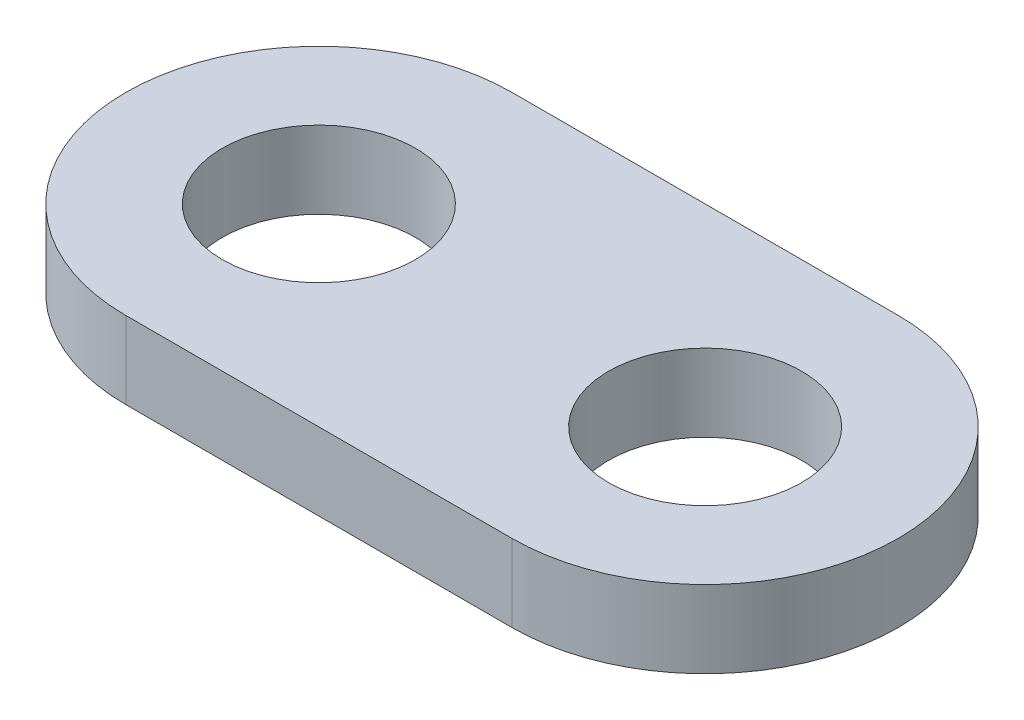
ISO-10303-21;
HEADER;
FILE_DESCRIPTION(('STEP AP214'),'2;1');
FILE_NAME('part.step','',(''),(''),'','','');
FILE_SCHEMA(('AUTOMOTIVE_DESIGN { 1 0 10303 214 1 1 1 1 }'));
ENDSEC;
DATA;
#1=APPLICATION_CONTEXT('core data for automotive mechanical design processes');
#2=APPLICATION_PROTOCOL_DEFINITION('international standard','automotive_design',2000,#1);
#3=PRODUCT_CONTEXT('',#1,'mechanical');
#4=PRODUCT('Part','Part','',(#3));
#5=PRODUCT_RELATED_PRODUCT_CATEGORY('part','',(#4));
#6=PRODUCT_DEFINITION_FORMATION('','',#4);
#7=PRODUCT_DEFINITION_CONTEXT('part definition',#1,'design');
#8=PRODUCT_DEFINITION('design','',#6,#7);
#9=PRODUCT_DEFINITION_SHAPE('','',#8);
#10=(LENGTH_UNIT() NAMED_UNIT(*) SI_UNIT(.MILLI.,.METRE.));
#11=(NAMED_UNIT(*) PLANE_ANGLE_UNIT() SI_UNIT($,.RADIAN.));
#12=(NAMED_UNIT(*) SI_UNIT($,.STERADIAN.) SOLID_ANGLE_UNIT());
#13=UNCERTAINTY_MEASURE_WITH_UNIT(LENGTH_MEASURE(1.E-05),#10,'distance_accuracy_value','');
#14=(GEOMETRIC_REPRESENTATION_CONTEXT(3) GLOBAL_UNCERTAINTY_ASSIGNED_CONTEXT((#13)) GLOBAL_UNIT_ASSIGNED_CONTEXT((#10,
#11,#12)) REPRESENTATION_CONTEXT('',''));
#15=CARTESIAN_POINT('',(0.,0.,0.));
#16=DIRECTION('',(0.,0.,1.));
#17=DIRECTION('',(1.,0.,0.));
#18=AXIS2_PLACEMENT_3D('',#15,#16,#17);
#19=CARTESIAN_POINT('',(-6.35,2.54,0.));
#20=DIRECTION('',(0.,1.,0.));
#21=DIRECTION('',(0.,0.,1.));
#22=AXIS2_PLACEMENT_3D('',#19,#20,#21);
#23=PLANE('',#22);
#24=CARTESIAN_POINT('',(-6.35,2.54,0.));
#25=DIRECTION('',(0.,1.,0.));
#26=DIRECTION('',(0.,0.,1.));
#27=AXIS2_PLACEMENT_3D('',#24,#25,#26);
#28=CIRCLE('',#27,3.175);
#29=CARTESIAN_POINT('',(-6.35,2.54,3.175));
#30=VERTEX_POINT('',#29);
#31=EDGE_CURVE('E100',#30,#30,#28,.T.);
#32=ORIENTED_EDGE('',*,*,#31,.F.);
#33=EDGE_LOOP('',(#32));
#34=FACE_BOUND('',#33,.T.);
#35=CARTESIAN_POINT('',(-6.35,2.54,0.));
#36=DIRECTION('',(0.,1.,0.));
#37=DIRECTION('',(0.,0.,1.));
#38=AXIS2_PLACEMENT_3D('',#35,#36,#37);
#39=CIRCLE('',#38,6.35);
#40=CARTESIAN_POINT('',(-6.35,2.54,-6.35));
#41=VERTEX_POINT('',#40);
#42=CARTESIAN_POINT('',(-6.35,2.54,6.35));
#43=VERTEX_POINT('',#42);
#44=EDGE_CURVE('E85',#41,#43,#39,.T.);
#45=ORIENTED_EDGE('',*,*,#44,.T.);
#46=DIRECTION('',(1.,0.,0.));
#47=VECTOR('',#46,1.);
#48=CARTESIAN_POINT('',(-6.35,2.54,6.35));
#49=LINE('',#48,#47);
#50=CARTESIAN_POINT('',(6.35,2.54,6.35));
#51=VERTEX_POINT('',#50);
#52=EDGE_CURVE('E80',#43,#51,#49,.T.);
#53=ORIENTED_EDGE('',*,*,#52,.T.);
#54=CARTESIAN_POINT('',(6.35,2.54,0.));
#55=DIRECTION('',(0.,1.,0.));
#56=DIRECTION('',(0.,0.,1.));
#57=AXIS2_PLACEMENT_3D('',#54,#55,#56);
#58=CIRCLE('',#57,6.35);
#59=CARTESIAN_POINT('',(6.35,2.54,-6.35000000000001));
#60=VERTEX_POINT('',#59);
#61=EDGE_CURVE('E83',#51,#60,#58,.T.);
#62=ORIENTED_EDGE('',*,*,#61,.T.);
#63=DIRECTION('',(-1.,0.,0.));
#64=VECTOR('',#63,1.);
#65=CARTESIAN_POINT('',(-6.35,2.54,-6.35));
#66=LINE('',#65,#64);
#67=EDGE_CURVE('E50',#60,#41,#66,.T.);
#68=ORIENTED_EDGE('',*,*,#67,.T.);
#69=EDGE_LOOP('',(#45,#53,#62,#68));
#70=FACE_BOUND('',#69,.T.);
#71=CARTESIAN_POINT('',(6.35,2.54,0.));
#72=DIRECTION('',(0.,1.,0.));
#73=DIRECTION('',(0.,0.,1.));
#74=AXIS2_PLACEMENT_3D('',#71,#72,#73);
#75=CIRCLE('',#74,3.175);
#76=CARTESIAN_POINT('',(6.35,2.54,3.175));
#77=VERTEX_POINT('',#76);
#78=EDGE_CURVE('E115',#77,#77,#75,.T.);
#79=ORIENTED_EDGE('',*,*,#78,.F.);
#80=EDGE_LOOP('',(#79));
#81=FACE_BOUND('',#80,.T.);
#82=ADVANCED_FACE('F33',(#34,#70,#81),#23,.T.);
#83=CARTESIAN_POINT('',(-6.35,0.,0.));
#84=DIRECTION('',(0.,1.,0.));
#85=DIRECTION('',(0.,0.,1.));
#86=AXIS2_PLACEMENT_3D('',#83,#84,#85);
#87=PLANE('',#86);
#88=CARTESIAN_POINT('',(-6.35,0.,0.));
#89=DIRECTION('',(0.,1.,0.));
#90=DIRECTION('',(0.,0.,1.));
#91=AXIS2_PLACEMENT_3D('',#88,#89,#90);
#92=CIRCLE('',#91,6.35);
#93=CARTESIAN_POINT('',(-6.35,0.,-6.35));
#94=VERTEX_POINT('',#93);
#95=CARTESIAN_POINT('',(-6.35,0.,6.35));
#96=VERTEX_POINT('',#95);
#97=EDGE_CURVE('E97',#94,#96,#92,.T.);
#98=ORIENTED_EDGE('',*,*,#97,.F.);
#99=DIRECTION('',(-1.,0.,0.));
#100=VECTOR('',#99,1.);
#101=CARTESIAN_POINT('',(-6.35,0.,-6.35));
#102=LINE('',#101,#100);
#103=CARTESIAN_POINT('',(6.35,0.,-6.35000000000001));
#104=VERTEX_POINT('',#103);
#105=EDGE_CURVE('E73',#104,#94,#102,.T.);
#106=ORIENTED_EDGE('',*,*,#105,.F.);
#107=CARTESIAN_POINT('',(6.35,0.,0.));
#108=DIRECTION('',(0.,1.,0.));
#109=DIRECTION('',(0.,0.,1.));
#110=AXIS2_PLACEMENT_3D('',#107,#108,#109);
#111=CIRCLE('',#110,6.35);
#112=CARTESIAN_POINT('',(6.35,0.,6.35));
#113=VERTEX_POINT('',#112);
#114=EDGE_CURVE('E67',#113,#104,#111,.T.);
#115=ORIENTED_EDGE('',*,*,#114,.F.);
#116=DIRECTION('',(1.,0.,0.));
#117=VECTOR('',#116,1.);
#118=CARTESIAN_POINT('',(-6.35,0.,6.35));
#119=LINE('',#118,#117);
#120=EDGE_CURVE('E89',#96,#113,#119,.T.);
#121=ORIENTED_EDGE('',*,*,#120,.F.);
#122=EDGE_LOOP('',(#98,#106,#115,#121));
#123=FACE_BOUND('',#122,.T.);
#124=CARTESIAN_POINT('',(-6.35,0.,0.));
#125=DIRECTION('',(0.,1.,0.));
#126=DIRECTION('',(0.,0.,1.));
#127=AXIS2_PLACEMENT_3D('',#124,#125,#126);
#128=CIRCLE('',#127,3.175);
#129=CARTESIAN_POINT('',(-6.35,0.,3.175));
#130=VERTEX_POINT('',#129);
#131=EDGE_CURVE('E112',#130,#130,#128,.T.);
#132=ORIENTED_EDGE('',*,*,#131,.T.);
#133=EDGE_LOOP('',(#132));
#134=FACE_BOUND('',#133,.T.);
#135=CARTESIAN_POINT('',(6.35,0.,0.));
#136=DIRECTION('',(0.,1.,0.));
#137=DIRECTION('',(0.,0.,1.));
#138=AXIS2_PLACEMENT_3D('',#135,#136,#137);
#139=CIRCLE('',#138,3.175);
#140=CARTESIAN_POINT('',(6.35,0.,3.175));
#141=VERTEX_POINT('',#140);
#142=EDGE_CURVE('E118',#141,#141,#139,.T.);
#143=ORIENTED_EDGE('',*,*,#142,.T.);
#144=EDGE_LOOP('',(#143));
#145=FACE_BOUND('',#144,.T.);
#146=ADVANCED_FACE('F108',(#123,#134,#145),#87,.F.);
#147=CARTESIAN_POINT('',(-6.35,2.54,0.));
#148=DIRECTION('',(0.,-1.,0.));
#149=DIRECTION('',(0.,0.,-1.));
#150=AXIS2_PLACEMENT_3D('',#147,#148,#149);
#151=CYLINDRICAL_SURFACE('',#150,6.35);
#152=ORIENTED_EDGE('',*,*,#97,.T.);
#153=DIRECTION('',(0.,-1.,0.));
#154=VECTOR('',#153,1.);
#155=CARTESIAN_POINT('',(-6.35,2.54,6.35));
#156=LINE('',#155,#154);
#157=EDGE_CURVE('E11',#43,#96,#156,.T.);
#158=ORIENTED_EDGE('',*,*,#157,.F.);
#159=ORIENTED_EDGE('',*,*,#44,.F.);
#160=DIRECTION('',(0.,-1.,0.));
#161=VECTOR('',#160,1.);
#162=CARTESIAN_POINT('',(-6.35,2.54,-6.35));
#163=LINE('',#162,#161);
#164=EDGE_CURVE('E93',#41,#94,#163,.T.);
#165=ORIENTED_EDGE('',*,*,#164,.T.);
#166=EDGE_LOOP('',(#152,#158,#159,#165));
#167=FACE_BOUND('',#166,.T.);
#168=ADVANCED_FACE('F35',(#167),#151,.T.);
#169=CARTESIAN_POINT('',(-6.35,2.54,6.35));
#170=DIRECTION('',(0.,0.,-1.));
#171=DIRECTION('',(-1.,0.,0.));
#172=AXIS2_PLACEMENT_3D('',#169,#170,#171);
#173=PLANE('',#172);
#174=ORIENTED_EDGE('',*,*,#120,.T.);
#175=DIRECTION('',(0.,-1.,0.));
#176=VECTOR('',#175,1.);
#177=CARTESIAN_POINT('',(6.35,2.54,6.35));
#178=LINE('',#177,#176);
#179=EDGE_CURVE('E42',#51,#113,#178,.T.);
#180=ORIENTED_EDGE('',*,*,#179,.F.);
#181=ORIENTED_EDGE('',*,*,#52,.F.);
#182=ORIENTED_EDGE('',*,*,#157,.T.);
#183=EDGE_LOOP('',(#174,#180,#181,#182));
#184=FACE_BOUND('',#183,.T.);
#185=ADVANCED_FACE('F88',(#184),#173,.F.);
#186=CARTESIAN_POINT('',(6.35,2.54,0.));
#187=DIRECTION('',(0.,-1.,0.));
#188=DIRECTION('',(0.,0.,-1.));
#189=AXIS2_PLACEMENT_3D('',#186,#187,#188);
#190=CYLINDRICAL_SURFACE('',#189,6.35);
#191=ORIENTED_EDGE('',*,*,#114,.T.);
#192=DIRECTION('',(0.,-1.,0.));
#193=VECTOR('',#192,1.);
#194=CARTESIAN_POINT('',(6.35,2.54,-6.35000000000001));
#195=LINE('',#194,#193);
#196=EDGE_CURVE('E90',#60,#104,#195,.T.);
#197=ORIENTED_EDGE('',*,*,#196,.F.);
#198=ORIENTED_EDGE('',*,*,#61,.F.);
#199=ORIENTED_EDGE('',*,*,#179,.T.);
#200=EDGE_LOOP('',(#191,#197,#198,#199));
#201=FACE_BOUND('',#200,.T.);
#202=ADVANCED_FACE('F91',(#201),#190,.T.);
#203=CARTESIAN_POINT('',(-6.35,2.54,-6.35));
#204=DIRECTION('',(0.,0.,1.));
#205=DIRECTION('',(1.,0.,0.));
#206=AXIS2_PLACEMENT_3D('',#203,#204,#205);
#207=PLANE('',#206);
#208=ORIENTED_EDGE('',*,*,#105,.T.);
#209=ORIENTED_EDGE('',*,*,#164,.F.);
#210=ORIENTED_EDGE('',*,*,#67,.F.);
#211=ORIENTED_EDGE('',*,*,#196,.T.);
#212=EDGE_LOOP('',(#208,#209,#210,#211));
#213=FACE_BOUND('',#212,.T.);
#214=ADVANCED_FACE('F105',(#213),#207,.F.);
#215=CARTESIAN_POINT('',(-6.35,2.54,0.));
#216=DIRECTION('',(0.,-1.,0.));
#217=DIRECTION('',(0.,0.,-1.));
#218=AXIS2_PLACEMENT_3D('',#215,#216,#217);
#219=CYLINDRICAL_SURFACE('',#218,3.175);
#220=ORIENTED_EDGE('',*,*,#31,.T.);
#221=EDGE_LOOP('',(#220));
#222=FACE_BOUND('',#221,.T.);
#223=ORIENTED_EDGE('',*,*,#131,.F.);
#224=EDGE_LOOP('',(#223));
#225=FACE_BOUND('',#224,.T.);
#226=ADVANCED_FACE('F135',(#222,#225),#219,.F.);
#227=CARTESIAN_POINT('',(6.35,2.54,0.));
#228=DIRECTION('',(0.,-1.,0.));
#229=DIRECTION('',(0.,0.,-1.));
#230=AXIS2_PLACEMENT_3D('',#227,#228,#229);
#231=CYLINDRICAL_SURFACE('',#230,3.175);
#232=ORIENTED_EDGE('',*,*,#78,.T.);
#233=EDGE_LOOP('',(#232));
#234=FACE_BOUND('',#233,.T.);
#235=ORIENTED_EDGE('',*,*,#142,.F.);
#236=EDGE_LOOP('',(#235));
#237=FACE_BOUND('',#236,.T.);
#238=ADVANCED_FACE('F124',(#234,#237),#231,.F.);
#239=CLOSED_SHELL('',(#82,#146,#168,#185,#202,#214,#226,#238));
#240=MANIFOLD_SOLID_BREP('B2',#239);
#241=ADVANCED_BREP_SHAPE_REPRESENTATION('',(#18,#240),#14);
#242=SHAPE_DEFINITION_REPRESENTATION(#9,#241);
ENDSEC;
END-ISO-10303-21;
